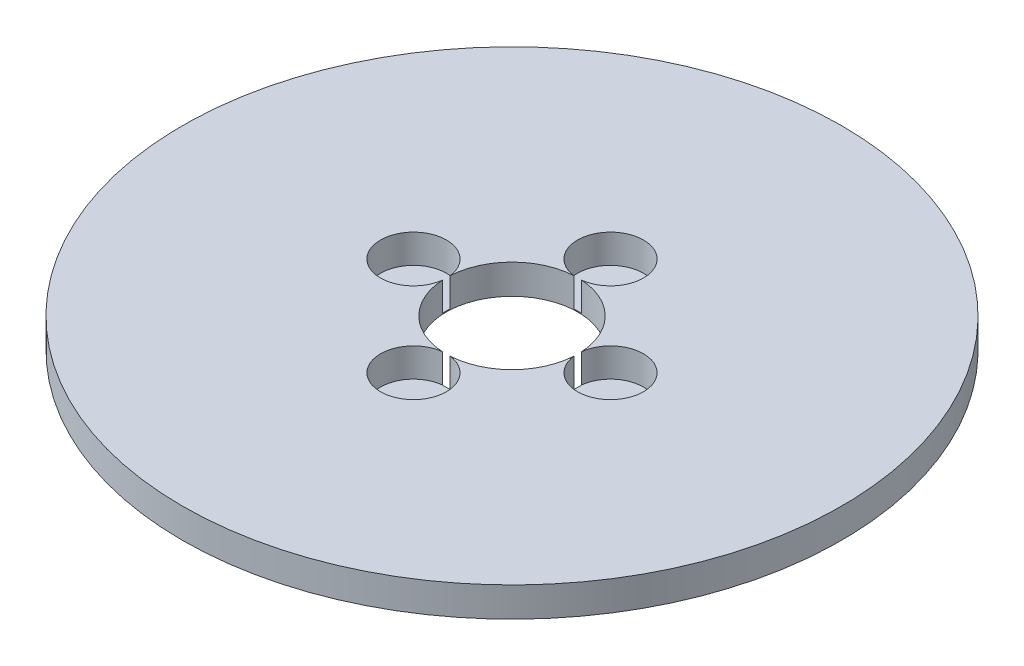
ISO-10303-21;
HEADER;
FILE_DESCRIPTION(('STEP AP214'),'2;1');
FILE_NAME('part.step','',(''),(''),'','','');
FILE_SCHEMA(('AUTOMOTIVE_DESIGN { 1 0 10303 214 1 1 1 1 }'));
ENDSEC;
DATA;
#1=APPLICATION_CONTEXT('core data for automotive mechanical design processes');
#2=APPLICATION_PROTOCOL_DEFINITION('international standard','automotive_design',2000,#1);
#3=PRODUCT_CONTEXT('',#1,'mechanical');
#4=PRODUCT('Part','Part','',(#3));
#5=PRODUCT_RELATED_PRODUCT_CATEGORY('part','',(#4));
#6=PRODUCT_DEFINITION_FORMATION('','',#4);
#7=PRODUCT_DEFINITION_CONTEXT('part definition',#1,'design');
#8=PRODUCT_DEFINITION('design','',#6,#7);
#9=PRODUCT_DEFINITION_SHAPE('','',#8);
#10=(LENGTH_UNIT() NAMED_UNIT(*) SI_UNIT(.MILLI.,.METRE.));
#11=(NAMED_UNIT(*) PLANE_ANGLE_UNIT() SI_UNIT($,.RADIAN.));
#12=(NAMED_UNIT(*) SI_UNIT($,.STERADIAN.) SOLID_ANGLE_UNIT());
#13=UNCERTAINTY_MEASURE_WITH_UNIT(LENGTH_MEASURE(1.E-05),#10,'distance_accuracy_value','');
#14=(GEOMETRIC_REPRESENTATION_CONTEXT(3) GLOBAL_UNCERTAINTY_ASSIGNED_CONTEXT((#13)) GLOBAL_UNIT_ASSIGNED_CONTEXT((#10,
#11,#12)) REPRESENTATION_CONTEXT('',''));
#15=CARTESIAN_POINT('',(0.,0.,0.));
#16=DIRECTION('',(0.,0.,1.));
#17=DIRECTION('',(1.,0.,0.));
#18=AXIS2_PLACEMENT_3D('',#15,#16,#17);
#19=CARTESIAN_POINT('',(0.,9.,0.));
#20=DIRECTION('',(0.,-1.,0.));
#21=DIRECTION('',(0.,0.,-1.));
#22=AXIS2_PLACEMENT_3D('',#19,#20,#21);
#23=CYLINDRICAL_SURFACE('',#22,100.);
#24=CARTESIAN_POINT('',(0.,9.,0.));
#25=DIRECTION('',(0.,1.,0.));
#26=DIRECTION('',(0.,0.,1.));
#27=AXIS2_PLACEMENT_3D('',#24,#25,#26);
#28=CIRCLE('',#27,100.);
#29=CARTESIAN_POINT('',(0.,9.,100.));
#30=VERTEX_POINT('',#29);
#31=EDGE_CURVE('E145',#30,#30,#28,.T.);
#32=ORIENTED_EDGE('',*,*,#31,.F.);
#33=EDGE_LOOP('',(#32));
#34=FACE_BOUND('',#33,.T.);
#35=CARTESIAN_POINT('',(0.,0.,0.));
#36=DIRECTION('',(0.,1.,0.));
#37=DIRECTION('',(0.,0.,1.));
#38=AXIS2_PLACEMENT_3D('',#35,#36,#37);
#39=CIRCLE('',#38,100.);
#40=CARTESIAN_POINT('',(0.,0.,100.));
#41=VERTEX_POINT('',#40);
#42=EDGE_CURVE('E143',#41,#41,#39,.T.);
#43=ORIENTED_EDGE('',*,*,#42,.T.);
#44=EDGE_LOOP('',(#43));
#45=FACE_BOUND('',#44,.T.);
#46=ADVANCED_FACE('F39',(#34,#45),#23,.T.);
#47=CARTESIAN_POINT('',(0.,9.,0.));
#48=DIRECTION('',(0.,1.,0.));
#49=DIRECTION('',(0.,0.,1.));
#50=AXIS2_PLACEMENT_3D('',#47,#48,#49);
#51=PLANE('',#50);
#52=CARTESIAN_POINT('',(1.04378699943675E-13,9.,29.8952478372001));
#53=DIRECTION('',(0.,1.,0.));
#54=DIRECTION('',(1.,0.,0.));
#55=AXIS2_PLACEMENT_3D('',#52,#53,#54);
#56=CIRCLE('',#55,10.);
#57=CARTESIAN_POINT('',(-1.18026842551064,9.,19.9651437872043));
#58=VERTEX_POINT('',#57);
#59=CARTESIAN_POINT('',(1.18026842551078,9.,19.9651437872043));
#60=VERTEX_POINT('',#59);
#61=EDGE_CURVE('E152',#58,#60,#56,.T.);
#62=ORIENTED_EDGE('',*,*,#61,.F.);
#63=CARTESIAN_POINT('',(0.,9.,0.));
#64=DIRECTION('',(0.,1.,0.));
#65=DIRECTION('',(0.,0.,1.));
#66=AXIS2_PLACEMENT_3D('',#63,#64,#65);
#67=CIRCLE('',#66,20.);
#68=CARTESIAN_POINT('',(-19.9651437872043,9.,1.18026842551071));
#69=VERTEX_POINT('',#68);
#70=EDGE_CURVE('E133',#69,#58,#67,.T.);
#71=ORIENTED_EDGE('',*,*,#70,.F.);
#72=CARTESIAN_POINT('',(-29.8952478372001,9.,0.));
#73=DIRECTION('',(0.,1.,0.));
#74=DIRECTION('',(0.,0.,1.));
#75=AXIS2_PLACEMENT_3D('',#72,#73,#74);
#76=CIRCLE('',#75,10.);
#77=CARTESIAN_POINT('',(-19.9651437872043,9.,-1.18026842551071));
#78=VERTEX_POINT('',#77);
#79=EDGE_CURVE('E128',#78,#69,#76,.T.);
#80=ORIENTED_EDGE('',*,*,#79,.F.);
#81=CARTESIAN_POINT('',(-1.18026842551092,9.,-19.9651437872043));
#82=VERTEX_POINT('',#81);
#83=EDGE_CURVE('E121',#82,#78,#67,.T.);
#84=ORIENTED_EDGE('',*,*,#83,.F.);
#85=CARTESIAN_POINT('',(-3.13136099831024E-13,9.,-29.8952478372001));
#86=DIRECTION('',(0.,1.,0.));
#87=DIRECTION('',(-1.,0.,0.));
#88=AXIS2_PLACEMENT_3D('',#85,#86,#87);
#89=CIRCLE('',#88,10.);
#90=CARTESIAN_POINT('',(1.1802684255105,9.,-19.9651437872043));
#91=VERTEX_POINT('',#90);
#92=EDGE_CURVE('E105',#91,#82,#89,.T.);
#93=ORIENTED_EDGE('',*,*,#92,.F.);
#94=CARTESIAN_POINT('',(19.9651437872043,9.,-1.18026842551071));
#95=VERTEX_POINT('',#94);
#96=EDGE_CURVE('E131',#95,#91,#67,.T.);
#97=ORIENTED_EDGE('',*,*,#96,.F.);
#98=CARTESIAN_POINT('',(29.8952478372001,9.,0.));
#99=DIRECTION('',(0.,1.,0.));
#100=DIRECTION('',(0.,0.,-1.));
#101=AXIS2_PLACEMENT_3D('',#98,#99,#100);
#102=CIRCLE('',#101,10.);
#103=CARTESIAN_POINT('',(19.9651437872043,9.,1.18026842551071));
#104=VERTEX_POINT('',#103);
#105=EDGE_CURVE('E154',#104,#95,#102,.T.);
#106=ORIENTED_EDGE('',*,*,#105,.F.);
#107=EDGE_CURVE('E134',#60,#104,#67,.T.);
#108=ORIENTED_EDGE('',*,*,#107,.F.);
#109=EDGE_LOOP('',(#62,#71,#80,#84,#93,#97,#106,#108));
#110=FACE_BOUND('',#109,.T.);
#111=ORIENTED_EDGE('',*,*,#31,.T.);
#112=EDGE_LOOP('',(#111));
#113=FACE_BOUND('',#112,.T.);
#114=ADVANCED_FACE('F130',(#110,#113),#51,.T.);
#115=CARTESIAN_POINT('',(0.,0.,0.));
#116=DIRECTION('',(0.,1.,0.));
#117=DIRECTION('',(0.,0.,1.));
#118=AXIS2_PLACEMENT_3D('',#115,#116,#117);
#119=PLANE('',#118);
#120=CARTESIAN_POINT('',(0.,0.,0.));
#121=DIRECTION('',(0.,1.,0.));
#122=DIRECTION('',(0.,0.,1.));
#123=AXIS2_PLACEMENT_3D('',#120,#121,#122);
#124=CIRCLE('',#123,20.);
#125=CARTESIAN_POINT('',(0.,0.,20.));
#126=VERTEX_POINT('',#125);
#127=EDGE_CURVE('E135',#126,#126,#124,.T.);
#128=ORIENTED_EDGE('',*,*,#127,.T.);
#129=EDGE_LOOP('',(#128));
#130=FACE_BOUND('',#129,.T.);
#131=ORIENTED_EDGE('',*,*,#42,.F.);
#132=EDGE_LOOP('',(#131));
#133=FACE_BOUND('',#132,.T.);
#134=ADVANCED_FACE('F195',(#130,#133),#119,.F.);
#135=CARTESIAN_POINT('',(0.,9.,0.));
#136=DIRECTION('',(0.,-1.,0.));
#137=DIRECTION('',(0.,0.,-1.));
#138=AXIS2_PLACEMENT_3D('',#135,#136,#137);
#139=CYLINDRICAL_SURFACE('',#138,20.);
#140=DIRECTION('',(0.,1.,0.));
#141=VECTOR('',#140,1.);
#142=CARTESIAN_POINT('',(-1.18026842551066,4.62756887185255,19.9651437872043));
#143=LINE('',#142,#141);
#144=CARTESIAN_POINT('',(-1.18026842551064,0.255137743705095,19.9651437872043));
#145=VERTEX_POINT('',#144);
#146=EDGE_CURVE('E11',#145,#58,#143,.T.);
#147=ORIENTED_EDGE('',*,*,#146,.F.);
#148=CARTESIAN_POINT('',(0.,0.255137743705095,0.));
#149=DIRECTION('',(0.,1.,0.));
#150=DIRECTION('',(0.,0.,1.));
#151=AXIS2_PLACEMENT_3D('',#148,#149,#150);
#152=CIRCLE('',#151,20.);
#153=CARTESIAN_POINT('',(1.18026842551078,0.255137743705095,19.9651437872043));
#154=VERTEX_POINT('',#153);
#155=EDGE_CURVE('E169',#145,#154,#152,.T.);
#156=ORIENTED_EDGE('',*,*,#155,.T.);
#157=DIRECTION('',(0.,1.,0.));
#158=VECTOR('',#157,1.);
#159=CARTESIAN_POINT('',(1.1802684255108,4.62756887185255,19.9651437872043));
#160=LINE('',#159,#158);
#161=EDGE_CURVE('E46',#60,#154,#160,.F.);
#162=ORIENTED_EDGE('',*,*,#161,.F.);
#163=ORIENTED_EDGE('',*,*,#107,.T.);
#164=DIRECTION('',(0.,1.,0.));
#165=VECTOR('',#164,1.);
#166=CARTESIAN_POINT('',(19.9651437872043,4.62756887185255,1.18026842551073));
#167=LINE('',#166,#165);
#168=CARTESIAN_POINT('',(19.9651437872043,0.255137743705095,1.18026842551071));
#169=VERTEX_POINT('',#168);
#170=EDGE_CURVE('E151',#169,#104,#167,.T.);
#171=ORIENTED_EDGE('',*,*,#170,.F.);
#172=CARTESIAN_POINT('',(0.,0.255137743705095,0.));
#173=DIRECTION('',(0.,1.,0.));
#174=DIRECTION('',(0.,0.,1.));
#175=AXIS2_PLACEMENT_3D('',#172,#173,#174);
#176=CIRCLE('',#175,20.);
#177=CARTESIAN_POINT('',(19.9651437872043,0.255137743705095,-1.18026842551071));
#178=VERTEX_POINT('',#177);
#179=EDGE_CURVE('E173',#169,#178,#176,.T.);
#180=ORIENTED_EDGE('',*,*,#179,.T.);
#181=DIRECTION('',(0.,1.,0.));
#182=VECTOR('',#181,1.);
#183=CARTESIAN_POINT('',(19.9651437872043,4.62756887185255,-1.18026842551073));
#184=LINE('',#183,#182);
#185=EDGE_CURVE('E168',#95,#178,#184,.F.);
#186=ORIENTED_EDGE('',*,*,#185,.F.);
#187=ORIENTED_EDGE('',*,*,#96,.T.);
#188=DIRECTION('',(0.,1.,0.));
#189=VECTOR('',#188,1.);
#190=CARTESIAN_POINT('',(1.18026842551052,4.62756887185255,-19.9651437872043));
#191=LINE('',#190,#189);
#192=CARTESIAN_POINT('',(1.1802684255105,0.255137743705095,-19.9651437872043));
#193=VERTEX_POINT('',#192);
#194=EDGE_CURVE('E108',#193,#91,#191,.T.);
#195=ORIENTED_EDGE('',*,*,#194,.F.);
#196=CARTESIAN_POINT('',(0.,0.255137743705095,0.));
#197=DIRECTION('',(0.,1.,0.));
#198=DIRECTION('',(0.,0.,1.));
#199=AXIS2_PLACEMENT_3D('',#196,#197,#198);
#200=CIRCLE('',#199,20.);
#201=CARTESIAN_POINT('',(-1.18026842551092,0.255137743705095,-19.9651437872043));
#202=VERTEX_POINT('',#201);
#203=EDGE_CURVE('E122',#193,#202,#200,.T.);
#204=ORIENTED_EDGE('',*,*,#203,.T.);
#205=DIRECTION('',(0.,1.,0.));
#206=VECTOR('',#205,1.);
#207=CARTESIAN_POINT('',(-1.18026842551094,4.62756887185255,-19.9651437872043));
#208=LINE('',#207,#206);
#209=EDGE_CURVE('E106',#82,#202,#208,.F.);
#210=ORIENTED_EDGE('',*,*,#209,.F.);
#211=ORIENTED_EDGE('',*,*,#83,.T.);
#212=DIRECTION('',(0.,1.,0.));
#213=VECTOR('',#212,1.);
#214=CARTESIAN_POINT('',(-19.9651437872043,4.62756887185255,-1.18026842551073));
#215=LINE('',#214,#213);
#216=CARTESIAN_POINT('',(-19.9651437872043,0.255137743705095,-1.18026842551071));
#217=VERTEX_POINT('',#216);
#218=EDGE_CURVE('E177',#217,#78,#215,.T.);
#219=ORIENTED_EDGE('',*,*,#218,.F.);
#220=CARTESIAN_POINT('',(0.,0.255137743705095,0.));
#221=DIRECTION('',(0.,1.,0.));
#222=DIRECTION('',(0.,0.,1.));
#223=AXIS2_PLACEMENT_3D('',#220,#221,#222);
#224=CIRCLE('',#223,20.);
#225=CARTESIAN_POINT('',(-19.9651437872043,0.255137743705095,1.18026842551071));
#226=VERTEX_POINT('',#225);
#227=EDGE_CURVE('E185',#217,#226,#224,.T.);
#228=ORIENTED_EDGE('',*,*,#227,.T.);
#229=DIRECTION('',(0.,1.,0.));
#230=VECTOR('',#229,1.);
#231=CARTESIAN_POINT('',(-19.9651437872043,4.62756887185255,1.18026842551073));
#232=LINE('',#231,#230);
#233=EDGE_CURVE('E179',#69,#226,#232,.F.);
#234=ORIENTED_EDGE('',*,*,#233,.F.);
#235=ORIENTED_EDGE('',*,*,#70,.T.);
#236=EDGE_LOOP('',(#147,#156,#162,#163,#171,#180,#186,#187,#195,#204,#210,#211,#219,#228,#234,#235));
#237=FACE_BOUND('',#236,.T.);
#238=ORIENTED_EDGE('',*,*,#127,.F.);
#239=EDGE_LOOP('',(#238));
#240=FACE_BOUND('',#239,.T.);
#241=ADVANCED_FACE('F117',(#237,#240),#139,.F.);
#242=CARTESIAN_POINT('',(-29.8952478372001,0.255137743705095,0.));
#243=DIRECTION('',(0.,1.,0.));
#244=DIRECTION('',(0.,0.,1.));
#245=AXIS2_PLACEMENT_3D('',#242,#243,#244);
#246=CYLINDRICAL_SURFACE('',#245,10.);
#247=ORIENTED_EDGE('',*,*,#218,.T.);
#248=ORIENTED_EDGE('',*,*,#79,.T.);
#249=ORIENTED_EDGE('',*,*,#233,.T.);
#250=CARTESIAN_POINT('',(-29.8952478372001,0.255137743705095,0.));
#251=DIRECTION('',(0.,1.,0.));
#252=DIRECTION('',(0.,0.,1.));
#253=AXIS2_PLACEMENT_3D('',#250,#251,#252);
#254=CIRCLE('',#253,10.);
#255=EDGE_CURVE('E140',#217,#226,#254,.T.);
#256=ORIENTED_EDGE('',*,*,#255,.F.);
#257=EDGE_LOOP('',(#247,#248,#249,#256));
#258=FACE_BOUND('',#257,.T.);
#259=ADVANCED_FACE('F200',(#258),#246,.F.);
#260=CARTESIAN_POINT('',(-29.8952478372001,0.255137743705095,0.));
#261=DIRECTION('',(0.,1.,0.));
#262=DIRECTION('',(0.,0.,1.));
#263=AXIS2_PLACEMENT_3D('',#260,#261,#262);
#264=PLANE('',#263);
#265=ORIENTED_EDGE('',*,*,#255,.T.);
#266=ORIENTED_EDGE('',*,*,#227,.F.);
#267=EDGE_LOOP('',(#265,#266));
#268=FACE_BOUND('',#267,.T.);
#269=ADVANCED_FACE('F202',(#268),#264,.T.);
#270=CARTESIAN_POINT('',(-3.13136099831024E-13,0.255137743705095,-29.8952478372001));
#271=DIRECTION('',(0.,1.,0.));
#272=DIRECTION('',(0.,0.,1.));
#273=AXIS2_PLACEMENT_3D('',#270,#271,#272);
#274=CYLINDRICAL_SURFACE('',#273,10.);
#275=ORIENTED_EDGE('',*,*,#194,.T.);
#276=ORIENTED_EDGE('',*,*,#92,.T.);
#277=ORIENTED_EDGE('',*,*,#209,.T.);
#278=CARTESIAN_POINT('',(-3.13136099831024E-13,0.255137743705095,-29.8952478372001));
#279=DIRECTION('',(0.,1.,0.));
#280=DIRECTION('',(-1.,0.,0.));
#281=AXIS2_PLACEMENT_3D('',#278,#279,#280);
#282=CIRCLE('',#281,10.);
#283=EDGE_CURVE('E111',#193,#202,#282,.T.);
#284=ORIENTED_EDGE('',*,*,#283,.F.);
#285=EDGE_LOOP('',(#275,#276,#277,#284));
#286=FACE_BOUND('',#285,.T.);
#287=ADVANCED_FACE('F102',(#286),#274,.F.);
#288=CARTESIAN_POINT('',(-3.13136099831024E-13,0.255137743705095,-29.8952478372001));
#289=DIRECTION('',(0.,1.,0.));
#290=DIRECTION('',(-1.,0.,0.));
#291=AXIS2_PLACEMENT_3D('',#288,#289,#290);
#292=PLANE('',#291);
#293=ORIENTED_EDGE('',*,*,#283,.T.);
#294=ORIENTED_EDGE('',*,*,#203,.F.);
#295=EDGE_LOOP('',(#293,#294));
#296=FACE_BOUND('',#295,.T.);
#297=ADVANCED_FACE('F211',(#296),#292,.T.);
#298=CARTESIAN_POINT('',(29.8952478372001,0.255137743705095,0.));
#299=DIRECTION('',(0.,1.,0.));
#300=DIRECTION('',(0.,0.,1.));
#301=AXIS2_PLACEMENT_3D('',#298,#299,#300);
#302=CYLINDRICAL_SURFACE('',#301,10.);
#303=ORIENTED_EDGE('',*,*,#170,.T.);
#304=ORIENTED_EDGE('',*,*,#105,.T.);
#305=ORIENTED_EDGE('',*,*,#185,.T.);
#306=CARTESIAN_POINT('',(29.8952478372001,0.255137743705095,0.));
#307=DIRECTION('',(0.,1.,0.));
#308=DIRECTION('',(0.,0.,-1.));
#309=AXIS2_PLACEMENT_3D('',#306,#307,#308);
#310=CIRCLE('',#309,10.);
#311=EDGE_CURVE('E56',#169,#178,#310,.T.);
#312=ORIENTED_EDGE('',*,*,#311,.F.);
#313=EDGE_LOOP('',(#303,#304,#305,#312));
#314=FACE_BOUND('',#313,.T.);
#315=ADVANCED_FACE('F212',(#314),#302,.F.);
#316=CARTESIAN_POINT('',(29.8952478372001,0.255137743705095,0.));
#317=DIRECTION('',(0.,1.,0.));
#318=DIRECTION('',(0.,0.,-1.));
#319=AXIS2_PLACEMENT_3D('',#316,#317,#318);
#320=PLANE('',#319);
#321=ORIENTED_EDGE('',*,*,#311,.T.);
#322=ORIENTED_EDGE('',*,*,#179,.F.);
#323=EDGE_LOOP('',(#321,#322));
#324=FACE_BOUND('',#323,.T.);
#325=ADVANCED_FACE('F217',(#324),#320,.T.);
#326=CARTESIAN_POINT('',(1.04378699943675E-13,0.255137743705095,29.8952478372001));
#327=DIRECTION('',(0.,1.,0.));
#328=DIRECTION('',(0.,0.,1.));
#329=AXIS2_PLACEMENT_3D('',#326,#327,#328);
#330=CYLINDRICAL_SURFACE('',#329,10.);
#331=ORIENTED_EDGE('',*,*,#146,.T.);
#332=ORIENTED_EDGE('',*,*,#61,.T.);
#333=ORIENTED_EDGE('',*,*,#161,.T.);
#334=CARTESIAN_POINT('',(1.04378699943675E-13,0.255137743705095,29.8952478372001));
#335=DIRECTION('',(0.,1.,0.));
#336=DIRECTION('',(1.,0.,0.));
#337=AXIS2_PLACEMENT_3D('',#334,#335,#336);
#338=CIRCLE('',#337,10.);
#339=EDGE_CURVE('E55',#145,#154,#338,.T.);
#340=ORIENTED_EDGE('',*,*,#339,.F.);
#341=EDGE_LOOP('',(#331,#332,#333,#340));
#342=FACE_BOUND('',#341,.T.);
#343=ADVANCED_FACE('F170',(#342),#330,.F.);
#344=CARTESIAN_POINT('',(1.04378699943675E-13,0.255137743705095,29.8952478372001));
#345=DIRECTION('',(0.,1.,0.));
#346=DIRECTION('',(1.,0.,0.));
#347=AXIS2_PLACEMENT_3D('',#344,#345,#346);
#348=PLANE('',#347);
#349=ORIENTED_EDGE('',*,*,#339,.T.);
#350=ORIENTED_EDGE('',*,*,#155,.F.);
#351=EDGE_LOOP('',(#349,#350));
#352=FACE_BOUND('',#351,.T.);
#353=ADVANCED_FACE('F224',(#352),#348,.T.);
#354=CLOSED_SHELL('',(#46,#114,#134,#241,#259,#269,#287,#297,#315,#325,#343,#353));
#355=MANIFOLD_SOLID_BREP('B2',#354);
#356=ADVANCED_BREP_SHAPE_REPRESENTATION('',(#18,#355),#14);
#357=SHAPE_DEFINITION_REPRESENTATION(#9,#356);
ENDSEC;
END-ISO-10303-21;
